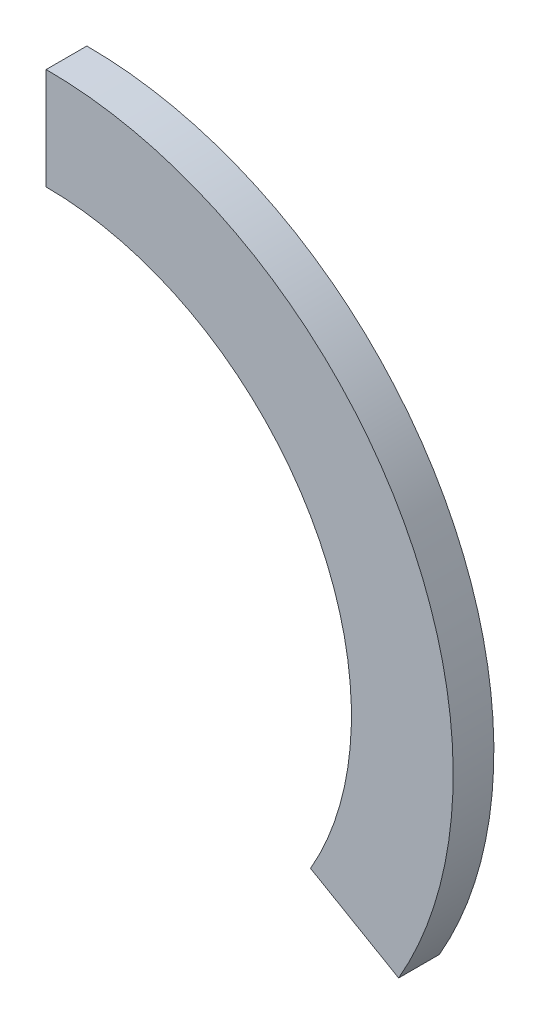
ISO-10303-21;
HEADER;
FILE_DESCRIPTION(('STEP AP214'),'2;1');
FILE_NAME('part.step','',(''),(''),'','','');
FILE_SCHEMA(('AUTOMOTIVE_DESIGN { 1 0 10303 214 1 1 1 1 }'));
ENDSEC;
DATA;
#1=APPLICATION_CONTEXT('core data for automotive mechanical design processes');
#2=APPLICATION_PROTOCOL_DEFINITION('international standard','automotive_design',2000,#1);
#3=PRODUCT_CONTEXT('',#1,'mechanical');
#4=PRODUCT('Part','Part','',(#3));
#5=PRODUCT_RELATED_PRODUCT_CATEGORY('part','',(#4));
#6=PRODUCT_DEFINITION_FORMATION('','',#4);
#7=PRODUCT_DEFINITION_CONTEXT('part definition',#1,'design');
#8=PRODUCT_DEFINITION('design','',#6,#7);
#9=PRODUCT_DEFINITION_SHAPE('','',#8);
#10=(LENGTH_UNIT() NAMED_UNIT(*) SI_UNIT(.MILLI.,.METRE.));
#11=(NAMED_UNIT(*) PLANE_ANGLE_UNIT() SI_UNIT($,.RADIAN.));
#12=(NAMED_UNIT(*) SI_UNIT($,.STERADIAN.) SOLID_ANGLE_UNIT());
#13=UNCERTAINTY_MEASURE_WITH_UNIT(LENGTH_MEASURE(1.E-05),#10,'distance_accuracy_value','');
#14=(GEOMETRIC_REPRESENTATION_CONTEXT(3) GLOBAL_UNCERTAINTY_ASSIGNED_CONTEXT((#13)) GLOBAL_UNIT_ASSIGNED_CONTEXT((#10,
#11,#12)) REPRESENTATION_CONTEXT('',''));
#15=CARTESIAN_POINT('',(0.,0.,0.));
#16=DIRECTION('',(0.,0.,1.));
#17=DIRECTION('',(1.,0.,0.));
#18=AXIS2_PLACEMENT_3D('',#15,#16,#17);
#19=CARTESIAN_POINT('',(51.961523814938,-30.0000007138274,8.));
#20=DIRECTION('',(0.500000000000003,0.866025403784437,0.));
#21=DIRECTION('',(-0.866025403784437,0.500000000000003,0.));
#22=AXIS2_PLACEMENT_3D('',#19,#20,#21);
#23=PLANE('',#22);
#24=DIRECTION('',(0.866025403784437,-0.500000000000002,0.));
#25=VECTOR('',#24,1.);
#26=CARTESIAN_POINT('',(51.961523814938,-30.0000007138274,0.));
#27=LINE('',#26,#25);
#28=CARTESIAN_POINT('',(51.9615238149379,-30.0000007138274,0.));
#29=VERTEX_POINT('',#28);
#30=CARTESIAN_POINT('',(69.2820318906267,-40.0000007138274,0.));
#31=VERTEX_POINT('',#30);
#32=EDGE_CURVE('E96',#29,#31,#27,.T.);
#33=ORIENTED_EDGE('',*,*,#32,.T.);
#34=DIRECTION('',(0.,0.,-1.));
#35=VECTOR('',#34,1.);
#36=CARTESIAN_POINT('',(69.2820318906267,-40.0000007138274,8.));
#37=LINE('',#36,#35);
#38=CARTESIAN_POINT('',(69.2820318906267,-40.0000007138274,8.));
#39=VERTEX_POINT('',#38);
#40=EDGE_CURVE('E11',#39,#31,#37,.T.);
#41=ORIENTED_EDGE('',*,*,#40,.F.);
#42=DIRECTION('',(0.866025403784437,-0.500000000000002,0.));
#43=VECTOR('',#42,1.);
#44=CARTESIAN_POINT('',(51.961523814938,-30.0000007138274,8.));
#45=LINE('',#44,#43);
#46=CARTESIAN_POINT('',(51.9615238149379,-30.0000007138274,8.));
#47=VERTEX_POINT('',#46);
#48=EDGE_CURVE('E82',#47,#39,#45,.T.);
#49=ORIENTED_EDGE('',*,*,#48,.F.);
#50=DIRECTION('',(0.,0.,-1.));
#51=VECTOR('',#50,1.);
#52=CARTESIAN_POINT('',(51.9615238149379,-30.0000007138274,8.));
#53=LINE('',#52,#51);
#54=EDGE_CURVE('E49',#47,#29,#53,.T.);
#55=ORIENTED_EDGE('',*,*,#54,.T.);
#56=EDGE_LOOP('',(#33,#41,#49,#55));
#57=FACE_BOUND('',#56,.T.);
#58=ADVANCED_FACE('F33',(#57),#23,.F.);
#59=CARTESIAN_POINT('',(0.,0.,8.));
#60=DIRECTION('',(0.,0.,-1.));
#61=DIRECTION('',(-1.,0.,0.));
#62=AXIS2_PLACEMENT_3D('',#59,#60,#61);
#63=CYLINDRICAL_SURFACE('',#62,80.);
#64=CARTESIAN_POINT('',(0.,0.,0.));
#65=DIRECTION('',(0.,0.,1.));
#66=DIRECTION('',(1.,0.,0.));
#67=AXIS2_PLACEMENT_3D('',#64,#65,#66);
#68=CIRCLE('',#67,80.);
#69=CARTESIAN_POINT('',(0.,80.,0.));
#70=VERTEX_POINT('',#69);
#71=EDGE_CURVE('E87',#31,#70,#68,.T.);
#72=ORIENTED_EDGE('',*,*,#71,.T.);
#73=DIRECTION('',(0.,0.,-1.));
#74=VECTOR('',#73,1.);
#75=CARTESIAN_POINT('',(0.,80.,8.));
#76=LINE('',#75,#74);
#77=CARTESIAN_POINT('',(0.,80.,8.));
#78=VERTEX_POINT('',#77);
#79=EDGE_CURVE('E41',#78,#70,#76,.T.);
#80=ORIENTED_EDGE('',*,*,#79,.F.);
#81=CARTESIAN_POINT('',(0.,0.,8.));
#82=DIRECTION('',(0.,0.,1.));
#83=DIRECTION('',(1.,0.,0.));
#84=AXIS2_PLACEMENT_3D('',#81,#82,#83);
#85=CIRCLE('',#84,80.);
#86=EDGE_CURVE('E74',#39,#78,#85,.T.);
#87=ORIENTED_EDGE('',*,*,#86,.F.);
#88=ORIENTED_EDGE('',*,*,#40,.T.);
#89=EDGE_LOOP('',(#72,#80,#87,#88));
#90=FACE_BOUND('',#89,.T.);
#91=ADVANCED_FACE('F86',(#90),#63,.T.);
#92=CARTESIAN_POINT('',(0.,60.,8.));
#93=DIRECTION('',(-1.,0.,0.));
#94=DIRECTION('',(0.,0.,1.));
#95=AXIS2_PLACEMENT_3D('',#92,#93,#94);
#96=PLANE('',#95);
#97=DIRECTION('',(0.,1.,0.));
#98=VECTOR('',#97,1.);
#99=CARTESIAN_POINT('',(0.,60.,0.));
#100=LINE('',#99,#98);
#101=CARTESIAN_POINT('',(0.,60.,0.));
#102=VERTEX_POINT('',#101);
#103=EDGE_CURVE('E99',#102,#70,#100,.T.);
#104=ORIENTED_EDGE('',*,*,#103,.F.);
#105=DIRECTION('',(0.,0.,-1.));
#106=VECTOR('',#105,1.);
#107=CARTESIAN_POINT('',(0.,60.,8.));
#108=LINE('',#107,#106);
#109=CARTESIAN_POINT('',(0.,60.,8.));
#110=VERTEX_POINT('',#109);
#111=EDGE_CURVE('E63',#110,#102,#108,.T.);
#112=ORIENTED_EDGE('',*,*,#111,.F.);
#113=DIRECTION('',(0.,1.,0.));
#114=VECTOR('',#113,1.);
#115=CARTESIAN_POINT('',(0.,60.,8.));
#116=LINE('',#115,#114);
#117=EDGE_CURVE('E81',#110,#78,#116,.T.);
#118=ORIENTED_EDGE('',*,*,#117,.T.);
#119=ORIENTED_EDGE('',*,*,#79,.T.);
#120=EDGE_LOOP('',(#104,#112,#118,#119));
#121=FACE_BOUND('',#120,.T.);
#122=ADVANCED_FACE('F90',(#121),#96,.T.);
#123=CARTESIAN_POINT('',(0.,0.,8.));
#124=DIRECTION('',(0.,0.,-1.));
#125=DIRECTION('',(-1.,0.,0.));
#126=AXIS2_PLACEMENT_3D('',#123,#124,#125);
#127=CYLINDRICAL_SURFACE('',#126,60.);
#128=CARTESIAN_POINT('',(0.,0.,0.));
#129=DIRECTION('',(0.,0.,1.));
#130=DIRECTION('',(1.,0.,0.));
#131=AXIS2_PLACEMENT_3D('',#128,#129,#130);
#132=CIRCLE('',#131,60.);
#133=EDGE_CURVE('E101',#29,#102,#132,.T.);
#134=ORIENTED_EDGE('',*,*,#133,.F.);
#135=ORIENTED_EDGE('',*,*,#54,.F.);
#136=CARTESIAN_POINT('',(0.,0.,8.));
#137=DIRECTION('',(0.,0.,1.));
#138=DIRECTION('',(1.,0.,0.));
#139=AXIS2_PLACEMENT_3D('',#136,#137,#138);
#140=CIRCLE('',#139,60.);
#141=EDGE_CURVE('E91',#47,#110,#140,.T.);
#142=ORIENTED_EDGE('',*,*,#141,.T.);
#143=ORIENTED_EDGE('',*,*,#111,.T.);
#144=EDGE_LOOP('',(#134,#135,#142,#143));
#145=FACE_BOUND('',#144,.T.);
#146=ADVANCED_FACE('F107',(#145),#127,.F.);
#147=CARTESIAN_POINT('',(0.,0.,8.));
#148=DIRECTION('',(0.,0.,1.));
#149=DIRECTION('',(1.,0.,0.));
#150=AXIS2_PLACEMENT_3D('',#147,#148,#149);
#151=PLANE('',#150);
#152=ORIENTED_EDGE('',*,*,#48,.T.);
#153=ORIENTED_EDGE('',*,*,#86,.T.);
#154=ORIENTED_EDGE('',*,*,#117,.F.);
#155=ORIENTED_EDGE('',*,*,#141,.F.);
#156=EDGE_LOOP('',(#152,#153,#154,#155));
#157=FACE_BOUND('',#156,.T.);
#158=ADVANCED_FACE('F78',(#157),#151,.T.);
#159=CARTESIAN_POINT('',(0.,0.,0.));
#160=DIRECTION('',(0.,0.,1.));
#161=DIRECTION('',(1.,0.,0.));
#162=AXIS2_PLACEMENT_3D('',#159,#160,#161);
#163=PLANE('',#162);
#164=ORIENTED_EDGE('',*,*,#32,.F.);
#165=ORIENTED_EDGE('',*,*,#133,.T.);
#166=ORIENTED_EDGE('',*,*,#103,.T.);
#167=ORIENTED_EDGE('',*,*,#71,.F.);
#168=EDGE_LOOP('',(#164,#165,#166,#167));
#169=FACE_BOUND('',#168,.T.);
#170=ADVANCED_FACE('F106',(#169),#163,.F.);
#171=CLOSED_SHELL('',(#58,#91,#122,#146,#158,#170));
#172=MANIFOLD_SOLID_BREP('B2',#171);
#173=ADVANCED_BREP_SHAPE_REPRESENTATION('',(#18,#172),#14);
#174=SHAPE_DEFINITION_REPRESENTATION(#9,#173);
ENDSEC;
END-ISO-10303-21;
